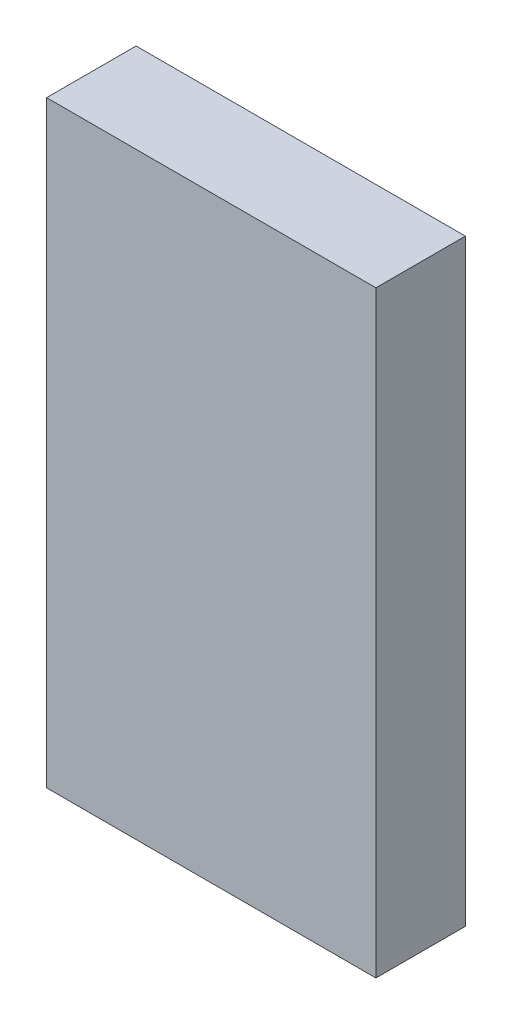
ISO-10303-21;
HEADER;
FILE_DESCRIPTION(('STEP AP214'),'2;1');
FILE_NAME('part.step','',(''),(''),'','','');
FILE_SCHEMA(('AUTOMOTIVE_DESIGN { 1 0 10303 214 1 1 1 1 }'));
ENDSEC;
DATA;
#1=APPLICATION_CONTEXT('core data for automotive mechanical design processes');
#2=APPLICATION_PROTOCOL_DEFINITION('international standard','automotive_design',2000,#1);
#3=PRODUCT_CONTEXT('',#1,'mechanical');
#4=PRODUCT('Part','Part','',(#3));
#5=PRODUCT_RELATED_PRODUCT_CATEGORY('part','',(#4));
#6=PRODUCT_DEFINITION_FORMATION('','',#4);
#7=PRODUCT_DEFINITION_CONTEXT('part definition',#1,'design');
#8=PRODUCT_DEFINITION('design','',#6,#7);
#9=PRODUCT_DEFINITION_SHAPE('','',#8);
#10=(LENGTH_UNIT() NAMED_UNIT(*) SI_UNIT(.MILLI.,.METRE.));
#11=(NAMED_UNIT(*) PLANE_ANGLE_UNIT() SI_UNIT($,.RADIAN.));
#12=(NAMED_UNIT(*) SI_UNIT($,.STERADIAN.) SOLID_ANGLE_UNIT());
#13=UNCERTAINTY_MEASURE_WITH_UNIT(LENGTH_MEASURE(1.E-05),#10,'distance_accuracy_value','');
#14=(GEOMETRIC_REPRESENTATION_CONTEXT(3) GLOBAL_UNCERTAINTY_ASSIGNED_CONTEXT((#13)) GLOBAL_UNIT_ASSIGNED_CONTEXT((#10,
#11,#12)) REPRESENTATION_CONTEXT('',''));
#15=CARTESIAN_POINT('',(0.,0.,0.));
#16=DIRECTION('',(0.,0.,1.));
#17=DIRECTION('',(1.,0.,0.));
#18=AXIS2_PLACEMENT_3D('',#15,#16,#17);
#19=CARTESIAN_POINT('',(-1.174,0.771,0.));
#20=DIRECTION('',(1.,0.,0.));
#21=DIRECTION('',(0.,0.,1.));
#22=AXIS2_PLACEMENT_3D('',#19,#20,#21);
#23=PLANE('',#22);
#24=DIRECTION('',(0.,1.,0.));
#25=VECTOR('',#24,1.);
#26=CARTESIAN_POINT('',(-1.174,0.771,0.1));
#27=LINE('',#26,#25);
#28=CARTESIAN_POINT('',(-1.174,0.771,0.1));
#29=VERTEX_POINT('',#28);
#30=CARTESIAN_POINT('',(-1.174,1.439,0.1));
#31=VERTEX_POINT('',#30);
#32=EDGE_CURVE('E11',#29,#31,#27,.T.);
#33=ORIENTED_EDGE('',*,*,#32,.T.);
#34=DIRECTION('',(0.,0.,1.));
#35=VECTOR('',#34,1.);
#36=CARTESIAN_POINT('',(-1.174,1.439,0.));
#37=LINE('',#36,#35);
#38=CARTESIAN_POINT('',(-1.174,1.439,0.));
#39=VERTEX_POINT('',#38);
#40=EDGE_CURVE('E24',#39,#31,#37,.T.);
#41=ORIENTED_EDGE('',*,*,#40,.F.);
#42=DIRECTION('',(0.,1.,0.));
#43=VECTOR('',#42,1.);
#44=CARTESIAN_POINT('',(-1.174,0.771,0.));
#45=LINE('',#44,#43);
#46=CARTESIAN_POINT('',(-1.174,0.771,0.));
#47=VERTEX_POINT('',#46);
#48=EDGE_CURVE('E86',#47,#39,#45,.T.);
#49=ORIENTED_EDGE('',*,*,#48,.F.);
#50=DIRECTION('',(0.,0.,1.));
#51=VECTOR('',#50,1.);
#52=CARTESIAN_POINT('',(-1.174,0.771,0.));
#53=LINE('',#52,#51);
#54=EDGE_CURVE('E36',#47,#29,#53,.T.);
#55=ORIENTED_EDGE('',*,*,#54,.T.);
#56=EDGE_LOOP('',(#33,#41,#49,#55));
#57=FACE_BOUND('',#56,.T.);
#58=ADVANCED_FACE('F17',(#57),#23,.F.);
#59=CARTESIAN_POINT('',(-0.806,0.771,0.));
#60=DIRECTION('',(1.,0.,0.));
#61=DIRECTION('',(0.,0.,1.));
#62=AXIS2_PLACEMENT_3D('',#59,#60,#61);
#63=PLANE('',#62);
#64=DIRECTION('',(0.,0.,1.));
#65=VECTOR('',#64,1.);
#66=CARTESIAN_POINT('',(-0.806,0.771,0.));
#67=LINE('',#66,#65);
#68=CARTESIAN_POINT('',(-0.806,0.771,0.));
#69=VERTEX_POINT('',#68);
#70=CARTESIAN_POINT('',(-0.806,0.771,0.1));
#71=VERTEX_POINT('',#70);
#72=EDGE_CURVE('E83',#69,#71,#67,.T.);
#73=ORIENTED_EDGE('',*,*,#72,.F.);
#74=DIRECTION('',(0.,1.,0.));
#75=VECTOR('',#74,1.);
#76=CARTESIAN_POINT('',(-0.806,0.771,0.));
#77=LINE('',#76,#75);
#78=CARTESIAN_POINT('',(-0.806,1.439,0.));
#79=VERTEX_POINT('',#78);
#80=EDGE_CURVE('E63',#69,#79,#77,.T.);
#81=ORIENTED_EDGE('',*,*,#80,.T.);
#82=DIRECTION('',(0.,0.,1.));
#83=VECTOR('',#82,1.);
#84=CARTESIAN_POINT('',(-0.806,1.439,0.));
#85=LINE('',#84,#83);
#86=CARTESIAN_POINT('',(-0.806,1.439,0.1));
#87=VERTEX_POINT('',#86);
#88=EDGE_CURVE('E57',#79,#87,#85,.T.);
#89=ORIENTED_EDGE('',*,*,#88,.T.);
#90=DIRECTION('',(0.,1.,0.));
#91=VECTOR('',#90,1.);
#92=CARTESIAN_POINT('',(-0.806,0.771,0.1));
#93=LINE('',#92,#91);
#94=EDGE_CURVE('E60',#71,#87,#93,.T.);
#95=ORIENTED_EDGE('',*,*,#94,.F.);
#96=EDGE_LOOP('',(#73,#81,#89,#95));
#97=FACE_BOUND('',#96,.T.);
#98=ADVANCED_FACE('F59',(#97),#63,.T.);
#99=CARTESIAN_POINT('',(-1.174,0.771,0.));
#100=DIRECTION('',(0.,1.,0.));
#101=DIRECTION('',(0.,0.,1.));
#102=AXIS2_PLACEMENT_3D('',#99,#100,#101);
#103=PLANE('',#102);
#104=ORIENTED_EDGE('',*,*,#72,.T.);
#105=DIRECTION('',(1.,0.,0.));
#106=VECTOR('',#105,1.);
#107=CARTESIAN_POINT('',(-1.174,0.771,0.1));
#108=LINE('',#107,#106);
#109=EDGE_CURVE('E71',#29,#71,#108,.T.);
#110=ORIENTED_EDGE('',*,*,#109,.F.);
#111=ORIENTED_EDGE('',*,*,#54,.F.);
#112=DIRECTION('',(1.,0.,0.));
#113=VECTOR('',#112,1.);
#114=CARTESIAN_POINT('',(-1.174,0.771,0.));
#115=LINE('',#114,#113);
#116=EDGE_CURVE('E76',#47,#69,#115,.T.);
#117=ORIENTED_EDGE('',*,*,#116,.T.);
#118=EDGE_LOOP('',(#104,#110,#111,#117));
#119=FACE_BOUND('',#118,.T.);
#120=ADVANCED_FACE('F91',(#119),#103,.F.);
#121=CARTESIAN_POINT('',(-1.174,1.439,0.));
#122=DIRECTION('',(0.,1.,0.));
#123=DIRECTION('',(0.,0.,1.));
#124=AXIS2_PLACEMENT_3D('',#121,#122,#123);
#125=PLANE('',#124);
#126=DIRECTION('',(1.,0.,0.));
#127=VECTOR('',#126,1.);
#128=CARTESIAN_POINT('',(-1.174,1.439,0.));
#129=LINE('',#128,#127);
#130=EDGE_CURVE('E74',#39,#79,#129,.T.);
#131=ORIENTED_EDGE('',*,*,#130,.F.);
#132=ORIENTED_EDGE('',*,*,#40,.T.);
#133=DIRECTION('',(1.,0.,0.));
#134=VECTOR('',#133,1.);
#135=CARTESIAN_POINT('',(-1.174,1.439,0.1));
#136=LINE('',#135,#134);
#137=EDGE_CURVE('E69',#31,#87,#136,.T.);
#138=ORIENTED_EDGE('',*,*,#137,.T.);
#139=ORIENTED_EDGE('',*,*,#88,.F.);
#140=EDGE_LOOP('',(#131,#132,#138,#139));
#141=FACE_BOUND('',#140,.T.);
#142=ADVANCED_FACE('F73',(#141),#125,.T.);
#143=CARTESIAN_POINT('',(-1.174,0.771,0.));
#144=DIRECTION('',(0.,0.,1.));
#145=DIRECTION('',(1.,0.,0.));
#146=AXIS2_PLACEMENT_3D('',#143,#144,#145);
#147=PLANE('',#146);
#148=ORIENTED_EDGE('',*,*,#130,.T.);
#149=ORIENTED_EDGE('',*,*,#80,.F.);
#150=ORIENTED_EDGE('',*,*,#116,.F.);
#151=ORIENTED_EDGE('',*,*,#48,.T.);
#152=EDGE_LOOP('',(#148,#149,#150,#151));
#153=FACE_BOUND('',#152,.T.);
#154=ADVANCED_FACE('F89',(#153),#147,.F.);
#155=CARTESIAN_POINT('',(-1.174,0.771,0.1));
#156=DIRECTION('',(0.,0.,1.));
#157=DIRECTION('',(1.,0.,0.));
#158=AXIS2_PLACEMENT_3D('',#155,#156,#157);
#159=PLANE('',#158);
#160=ORIENTED_EDGE('',*,*,#32,.F.);
#161=ORIENTED_EDGE('',*,*,#109,.T.);
#162=ORIENTED_EDGE('',*,*,#94,.T.);
#163=ORIENTED_EDGE('',*,*,#137,.F.);
#164=EDGE_LOOP('',(#160,#161,#162,#163));
#165=FACE_BOUND('',#164,.T.);
#166=ADVANCED_FACE('F68',(#165),#159,.T.);
#167=CLOSED_SHELL('',(#58,#98,#120,#142,#154,#166));
#168=MANIFOLD_SOLID_BREP('B1',#167);
#169=ADVANCED_BREP_SHAPE_REPRESENTATION('',(#18,#168),#14);
#170=SHAPE_DEFINITION_REPRESENTATION(#9,#169);
ENDSEC;
END-ISO-10303-21;
